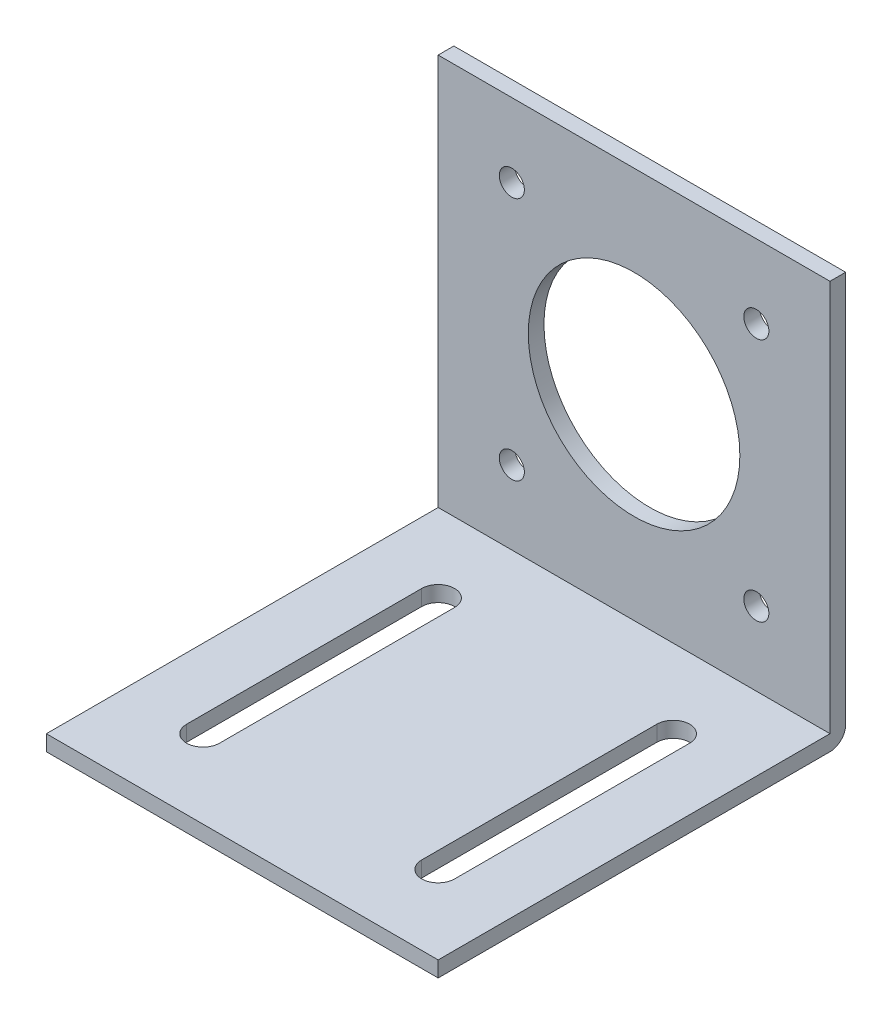
ISO-10303-21;
HEADER;
FILE_DESCRIPTION(('STEP AP214'),'2;1');
FILE_NAME('part.step','',(''),(''),'','','');
FILE_SCHEMA(('AUTOMOTIVE_DESIGN { 1 0 10303 214 1 1 1 1 }'));
ENDSEC;
DATA;
#1=APPLICATION_CONTEXT('core data for automotive mechanical design processes');
#2=APPLICATION_PROTOCOL_DEFINITION('international standard','automotive_design',2000,#1);
#3=PRODUCT_CONTEXT('',#1,'mechanical');
#4=PRODUCT('Part','Part','',(#3));
#5=PRODUCT_RELATED_PRODUCT_CATEGORY('part','',(#4));
#6=PRODUCT_DEFINITION_FORMATION('','',#4);
#7=PRODUCT_DEFINITION_CONTEXT('part definition',#1,'design');
#8=PRODUCT_DEFINITION('design','',#6,#7);
#9=PRODUCT_DEFINITION_SHAPE('','',#8);
#10=(LENGTH_UNIT() NAMED_UNIT(*) SI_UNIT(.MILLI.,.METRE.));
#11=(NAMED_UNIT(*) PLANE_ANGLE_UNIT() SI_UNIT($,.RADIAN.));
#12=(NAMED_UNIT(*) SI_UNIT($,.STERADIAN.) SOLID_ANGLE_UNIT());
#13=UNCERTAINTY_MEASURE_WITH_UNIT(LENGTH_MEASURE(1.E-05),#10,'distance_accuracy_value','');
#14=(GEOMETRIC_REPRESENTATION_CONTEXT(3) GLOBAL_UNCERTAINTY_ASSIGNED_CONTEXT((#13)) GLOBAL_UNIT_ASSIGNED_CONTEXT((#10,
#11,#12)) REPRESENTATION_CONTEXT('',''));
#15=CARTESIAN_POINT('',(0.,0.,0.));
#16=DIRECTION('',(0.,0.,1.));
#17=DIRECTION('',(1.,0.,0.));
#18=AXIS2_PLACEMENT_3D('',#15,#16,#17);
#19=CARTESIAN_POINT('',(0.,2.,0.));
#20=DIRECTION('',(0.,-1.,0.));
#21=DIRECTION('',(0.,0.,-1.));
#22=AXIS2_PLACEMENT_3D('',#19,#20,#21);
#23=PLANE('',#22);
#24=CARTESIAN_POINT('',(-15.,2.,-15.));
#25=DIRECTION('',(0.,1.,0.));
#26=DIRECTION('',(0.,0.,1.));
#27=AXIS2_PLACEMENT_3D('',#24,#25,#26);
#28=CIRCLE('',#27,2.1);
#29=CARTESIAN_POINT('',(-12.9,2.,-15.));
#30=VERTEX_POINT('',#29);
#31=CARTESIAN_POINT('',(-17.1,2.,-15.));
#32=VERTEX_POINT('',#31);
#33=EDGE_CURVE('E207',#30,#32,#28,.T.);
#34=ORIENTED_EDGE('',*,*,#33,.F.);
#35=DIRECTION('',(0.,0.,-1.));
#36=VECTOR('',#35,1.);
#37=CARTESIAN_POINT('',(-12.9,2.,-15.));
#38=LINE('',#37,#36);
#39=CARTESIAN_POINT('',(-12.9,2.,15.));
#40=VERTEX_POINT('',#39);
#41=EDGE_CURVE('E215',#40,#30,#38,.T.);
#42=ORIENTED_EDGE('',*,*,#41,.F.);
#43=CARTESIAN_POINT('',(-15.,2.,15.));
#44=DIRECTION('',(0.,1.,0.));
#45=DIRECTION('',(0.,0.,1.));
#46=AXIS2_PLACEMENT_3D('',#43,#44,#45);
#47=CIRCLE('',#46,2.1);
#48=CARTESIAN_POINT('',(-17.1,2.,15.));
#49=VERTEX_POINT('',#48);
#50=EDGE_CURVE('E212',#49,#40,#47,.T.);
#51=ORIENTED_EDGE('',*,*,#50,.F.);
#52=DIRECTION('',(0.,0.,1.));
#53=VECTOR('',#52,1.);
#54=CARTESIAN_POINT('',(-17.1,2.,-15.));
#55=LINE('',#54,#53);
#56=EDGE_CURVE('E209',#32,#49,#55,.T.);
#57=ORIENTED_EDGE('',*,*,#56,.F.);
#58=EDGE_LOOP('',(#34,#42,#51,#57));
#59=FACE_BOUND('',#58,.T.);
#60=DIRECTION('',(0.,0.,-1.));
#61=VECTOR('',#60,1.);
#62=CARTESIAN_POINT('',(25.,2.,25.));
#63=LINE('',#62,#61);
#64=CARTESIAN_POINT('',(25.,2.,25.));
#65=VERTEX_POINT('',#64);
#66=CARTESIAN_POINT('',(25.,2.00000000000002,-25.));
#67=VERTEX_POINT('',#66);
#68=EDGE_CURVE('E238',#65,#67,#63,.T.);
#69=ORIENTED_EDGE('',*,*,#68,.T.);
#70=DIRECTION('',(-1.,0.,0.));
#71=VECTOR('',#70,1.);
#72=CARTESIAN_POINT('',(-25.,2.,-25.));
#73=LINE('',#72,#71);
#74=CARTESIAN_POINT('',(-25.,2.,-25.));
#75=VERTEX_POINT('',#74);
#76=EDGE_CURVE('E143',#67,#75,#73,.T.);
#77=ORIENTED_EDGE('',*,*,#76,.T.);
#78=DIRECTION('',(0.,0.,1.));
#79=VECTOR('',#78,1.);
#80=CARTESIAN_POINT('',(-25.,2.,25.));
#81=LINE('',#80,#79);
#82=CARTESIAN_POINT('',(-25.,2.,25.));
#83=VERTEX_POINT('',#82);
#84=EDGE_CURVE('E242',#75,#83,#81,.T.);
#85=ORIENTED_EDGE('',*,*,#84,.T.);
#86=DIRECTION('',(1.,0.,0.));
#87=VECTOR('',#86,1.);
#88=CARTESIAN_POINT('',(-25.,2.,25.));
#89=LINE('',#88,#87);
#90=EDGE_CURVE('E244',#83,#65,#89,.T.);
#91=ORIENTED_EDGE('',*,*,#90,.T.);
#92=EDGE_LOOP('',(#69,#77,#85,#91));
#93=FACE_BOUND('',#92,.T.);
#94=CARTESIAN_POINT('',(15.,2.,-15.));
#95=DIRECTION('',(0.,1.,0.));
#96=DIRECTION('',(0.,0.,-1.));
#97=AXIS2_PLACEMENT_3D('',#94,#95,#96);
#98=CIRCLE('',#97,2.1);
#99=CARTESIAN_POINT('',(17.1,2.,-15.));
#100=VERTEX_POINT('',#99);
#101=CARTESIAN_POINT('',(12.9,2.,-15.));
#102=VERTEX_POINT('',#101);
#103=EDGE_CURVE('E176',#100,#102,#98,.T.);
#104=ORIENTED_EDGE('',*,*,#103,.F.);
#105=DIRECTION('',(0.,0.,-1.));
#106=VECTOR('',#105,1.);
#107=CARTESIAN_POINT('',(17.1,2.,-15.));
#108=LINE('',#107,#106);
#109=CARTESIAN_POINT('',(17.1,2.,15.));
#110=VERTEX_POINT('',#109);
#111=EDGE_CURVE('E184',#110,#100,#108,.T.);
#112=ORIENTED_EDGE('',*,*,#111,.F.);
#113=CARTESIAN_POINT('',(15.,2.,15.));
#114=DIRECTION('',(0.,1.,0.));
#115=DIRECTION('',(0.,0.,-1.));
#116=AXIS2_PLACEMENT_3D('',#113,#114,#115);
#117=CIRCLE('',#116,2.1);
#118=CARTESIAN_POINT('',(12.9,2.,15.));
#119=VERTEX_POINT('',#118);
#120=EDGE_CURVE('E181',#119,#110,#117,.T.);
#121=ORIENTED_EDGE('',*,*,#120,.F.);
#122=DIRECTION('',(0.,0.,1.));
#123=VECTOR('',#122,1.);
#124=CARTESIAN_POINT('',(12.9,2.,-15.));
#125=LINE('',#124,#123);
#126=EDGE_CURVE('E178',#102,#119,#125,.T.);
#127=ORIENTED_EDGE('',*,*,#126,.F.);
#128=EDGE_LOOP('',(#104,#112,#121,#127));
#129=FACE_BOUND('',#128,.T.);
#130=ADVANCED_FACE('F33',(#59,#93,#129),#23,.F.);
#131=CARTESIAN_POINT('',(0.,0.,0.));
#132=DIRECTION('',(0.,-1.,0.));
#133=DIRECTION('',(0.,0.,-1.));
#134=AXIS2_PLACEMENT_3D('',#131,#132,#133);
#135=PLANE('',#134);
#136=DIRECTION('',(0.,0.,1.));
#137=VECTOR('',#136,1.);
#138=CARTESIAN_POINT('',(-25.,0.,25.));
#139=LINE('',#138,#137);
#140=CARTESIAN_POINT('',(-25.,0.,-25.));
#141=VERTEX_POINT('',#140);
#142=CARTESIAN_POINT('',(-25.,0.,25.));
#143=VERTEX_POINT('',#142);
#144=EDGE_CURVE('E248',#141,#143,#139,.T.);
#145=ORIENTED_EDGE('',*,*,#144,.F.);
#146=DIRECTION('',(1.,0.,0.));
#147=VECTOR('',#146,1.);
#148=CARTESIAN_POINT('',(0.,0.,-25.));
#149=LINE('',#148,#147);
#150=CARTESIAN_POINT('',(25.,0.,-25.));
#151=VERTEX_POINT('',#150);
#152=EDGE_CURVE('E256',#141,#151,#149,.T.);
#153=ORIENTED_EDGE('',*,*,#152,.T.);
#154=DIRECTION('',(0.,0.,-1.));
#155=VECTOR('',#154,1.);
#156=CARTESIAN_POINT('',(25.,0.,25.));
#157=LINE('',#156,#155);
#158=CARTESIAN_POINT('',(25.,0.,25.));
#159=VERTEX_POINT('',#158);
#160=EDGE_CURVE('E237',#159,#151,#157,.T.);
#161=ORIENTED_EDGE('',*,*,#160,.F.);
#162=DIRECTION('',(1.,0.,0.));
#163=VECTOR('',#162,1.);
#164=CARTESIAN_POINT('',(-25.,0.,25.));
#165=LINE('',#164,#163);
#166=EDGE_CURVE('E240',#143,#159,#165,.T.);
#167=ORIENTED_EDGE('',*,*,#166,.F.);
#168=EDGE_LOOP('',(#145,#153,#161,#167));
#169=FACE_BOUND('',#168,.T.);
#170=DIRECTION('',(0.,0.,-1.));
#171=VECTOR('',#170,1.);
#172=CARTESIAN_POINT('',(-12.9,0.,-15.));
#173=LINE('',#172,#171);
#174=CARTESIAN_POINT('',(-12.9,0.,15.));
#175=VERTEX_POINT('',#174);
#176=CARTESIAN_POINT('',(-12.9,0.,-15.));
#177=VERTEX_POINT('',#176);
#178=EDGE_CURVE('E210',#175,#177,#173,.T.);
#179=ORIENTED_EDGE('',*,*,#178,.T.);
#180=CARTESIAN_POINT('',(-15.,0.,-15.));
#181=DIRECTION('',(0.,1.,0.));
#182=DIRECTION('',(0.,0.,1.));
#183=AXIS2_PLACEMENT_3D('',#180,#181,#182);
#184=CIRCLE('',#183,2.1);
#185=CARTESIAN_POINT('',(-17.1,0.,-15.));
#186=VERTEX_POINT('',#185);
#187=EDGE_CURVE('E206',#177,#186,#184,.T.);
#188=ORIENTED_EDGE('',*,*,#187,.T.);
#189=DIRECTION('',(0.,0.,1.));
#190=VECTOR('',#189,1.);
#191=CARTESIAN_POINT('',(-17.1,0.,-15.));
#192=LINE('',#191,#190);
#193=CARTESIAN_POINT('',(-17.1,0.,15.));
#194=VERTEX_POINT('',#193);
#195=EDGE_CURVE('E220',#186,#194,#192,.T.);
#196=ORIENTED_EDGE('',*,*,#195,.T.);
#197=CARTESIAN_POINT('',(-15.,0.,15.));
#198=DIRECTION('',(0.,1.,0.));
#199=DIRECTION('',(0.,0.,1.));
#200=AXIS2_PLACEMENT_3D('',#197,#198,#199);
#201=CIRCLE('',#200,2.1);
#202=EDGE_CURVE('E223',#194,#175,#201,.T.);
#203=ORIENTED_EDGE('',*,*,#202,.T.);
#204=EDGE_LOOP('',(#179,#188,#196,#203));
#205=FACE_BOUND('',#204,.T.);
#206=DIRECTION('',(0.,0.,-1.));
#207=VECTOR('',#206,1.);
#208=CARTESIAN_POINT('',(17.1,0.,-15.));
#209=LINE('',#208,#207);
#210=CARTESIAN_POINT('',(17.1,0.,15.));
#211=VERTEX_POINT('',#210);
#212=CARTESIAN_POINT('',(17.1,0.,-15.));
#213=VERTEX_POINT('',#212);
#214=EDGE_CURVE('E179',#211,#213,#209,.T.);
#215=ORIENTED_EDGE('',*,*,#214,.T.);
#216=CARTESIAN_POINT('',(15.,0.,-15.));
#217=DIRECTION('',(0.,1.,0.));
#218=DIRECTION('',(0.,0.,-1.));
#219=AXIS2_PLACEMENT_3D('',#216,#217,#218);
#220=CIRCLE('',#219,2.1);
#221=CARTESIAN_POINT('',(12.9,0.,-15.));
#222=VERTEX_POINT('',#221);
#223=EDGE_CURVE('E172',#213,#222,#220,.T.);
#224=ORIENTED_EDGE('',*,*,#223,.T.);
#225=DIRECTION('',(0.,0.,1.));
#226=VECTOR('',#225,1.);
#227=CARTESIAN_POINT('',(12.9,0.,-15.));
#228=LINE('',#227,#226);
#229=CARTESIAN_POINT('',(12.9,0.,15.));
#230=VERTEX_POINT('',#229);
#231=EDGE_CURVE('E189',#222,#230,#228,.T.);
#232=ORIENTED_EDGE('',*,*,#231,.T.);
#233=CARTESIAN_POINT('',(15.,0.,15.));
#234=DIRECTION('',(0.,1.,0.));
#235=DIRECTION('',(0.,0.,-1.));
#236=AXIS2_PLACEMENT_3D('',#233,#234,#235);
#237=CIRCLE('',#236,2.1);
#238=EDGE_CURVE('E192',#230,#211,#237,.T.);
#239=ORIENTED_EDGE('',*,*,#238,.T.);
#240=EDGE_LOOP('',(#215,#224,#232,#239));
#241=FACE_BOUND('',#240,.T.);
#242=ADVANCED_FACE('F263',(#169,#205,#241),#135,.T.);
#243=CARTESIAN_POINT('',(25.,2.,25.));
#244=DIRECTION('',(-1.,0.,0.));
#245=DIRECTION('',(0.,0.,1.));
#246=AXIS2_PLACEMENT_3D('',#243,#244,#245);
#247=PLANE('',#246);
#248=ORIENTED_EDGE('',*,*,#160,.T.);
#249=CARTESIAN_POINT('',(25.,2.,-25.));
#250=DIRECTION('',(-1.,0.,0.));
#251=DIRECTION('',(0.,0.,1.));
#252=AXIS2_PLACEMENT_3D('',#249,#250,#251);
#253=CIRCLE('',#252,2.);
#254=CARTESIAN_POINT('',(25.,2.00000000000002,-27.));
#255=VERTEX_POINT('',#254);
#256=EDGE_CURVE('E55',#151,#255,#253,.F.);
#257=ORIENTED_EDGE('',*,*,#256,.T.);
#258=DIRECTION('',(0.,-1.,0.));
#259=VECTOR('',#258,1.);
#260=CARTESIAN_POINT('',(25.,52.,-27.));
#261=LINE('',#260,#259);
#262=CARTESIAN_POINT('',(25.,52.,-27.));
#263=VERTEX_POINT('',#262);
#264=EDGE_CURVE('E161',#263,#255,#261,.T.);
#265=ORIENTED_EDGE('',*,*,#264,.F.);
#266=DIRECTION('',(0.,0.,1.));
#267=VECTOR('',#266,1.);
#268=CARTESIAN_POINT('',(25.,52.,-25.));
#269=LINE('',#268,#267);
#270=CARTESIAN_POINT('',(25.,52.,-25.));
#271=VERTEX_POINT('',#270);
#272=EDGE_CURVE('E155',#263,#271,#269,.T.);
#273=ORIENTED_EDGE('',*,*,#272,.T.);
#274=DIRECTION('',(0.,-1.,0.));
#275=VECTOR('',#274,1.);
#276=CARTESIAN_POINT('',(25.,52.,-25.));
#277=LINE('',#276,#275);
#278=EDGE_CURVE('E138',#271,#67,#277,.T.);
#279=ORIENTED_EDGE('',*,*,#278,.T.);
#280=ORIENTED_EDGE('',*,*,#68,.F.);
#281=DIRECTION('',(0.,-1.,0.));
#282=VECTOR('',#281,1.);
#283=CARTESIAN_POINT('',(25.,2.,25.));
#284=LINE('',#283,#282);
#285=EDGE_CURVE('E246',#65,#159,#284,.T.);
#286=ORIENTED_EDGE('',*,*,#285,.T.);
#287=EDGE_LOOP('',(#248,#257,#265,#273,#279,#280,#286));
#288=FACE_BOUND('',#287,.T.);
#289=ADVANCED_FACE('F160',(#288),#247,.F.);
#290=CARTESIAN_POINT('',(-25.,2.,25.));
#291=DIRECTION('',(1.,0.,0.));
#292=DIRECTION('',(0.,0.,-1.));
#293=AXIS2_PLACEMENT_3D('',#290,#291,#292);
#294=PLANE('',#293);
#295=DIRECTION('',(0.,-1.,0.));
#296=VECTOR('',#295,1.);
#297=CARTESIAN_POINT('',(-25.,52.,-27.));
#298=LINE('',#297,#296);
#299=CARTESIAN_POINT('',(-25.,52.,-27.));
#300=VERTEX_POINT('',#299);
#301=CARTESIAN_POINT('',(-25.,2.00000000000002,-27.));
#302=VERTEX_POINT('',#301);
#303=EDGE_CURVE('E173',#300,#302,#298,.T.);
#304=ORIENTED_EDGE('',*,*,#303,.T.);
#305=CARTESIAN_POINT('',(-25.,2.,-25.));
#306=DIRECTION('',(1.,0.,0.));
#307=DIRECTION('',(0.,0.,-1.));
#308=AXIS2_PLACEMENT_3D('',#305,#306,#307);
#309=CIRCLE('',#308,2.);
#310=EDGE_CURVE('E11',#302,#141,#309,.F.);
#311=ORIENTED_EDGE('',*,*,#310,.T.);
#312=ORIENTED_EDGE('',*,*,#144,.T.);
#313=DIRECTION('',(0.,-1.,0.));
#314=VECTOR('',#313,1.);
#315=CARTESIAN_POINT('',(-25.,2.,25.));
#316=LINE('',#315,#314);
#317=EDGE_CURVE('E253',#83,#143,#316,.T.);
#318=ORIENTED_EDGE('',*,*,#317,.F.);
#319=ORIENTED_EDGE('',*,*,#84,.F.);
#320=DIRECTION('',(0.,-1.,0.));
#321=VECTOR('',#320,1.);
#322=CARTESIAN_POINT('',(-25.,52.,-25.));
#323=LINE('',#322,#321);
#324=CARTESIAN_POINT('',(-25.,52.,-25.));
#325=VERTEX_POINT('',#324);
#326=EDGE_CURVE('E147',#325,#75,#323,.T.);
#327=ORIENTED_EDGE('',*,*,#326,.F.);
#328=DIRECTION('',(0.,0.,-1.));
#329=VECTOR('',#328,1.);
#330=CARTESIAN_POINT('',(-25.,52.,-25.));
#331=LINE('',#330,#329);
#332=EDGE_CURVE('E158',#325,#300,#331,.T.);
#333=ORIENTED_EDGE('',*,*,#332,.T.);
#334=EDGE_LOOP('',(#304,#311,#312,#318,#319,#327,#333));
#335=FACE_BOUND('',#334,.T.);
#336=ADVANCED_FACE('F275',(#335),#294,.F.);
#337=CARTESIAN_POINT('',(-25.,2.,25.));
#338=DIRECTION('',(0.,0.,-1.));
#339=DIRECTION('',(-1.,0.,0.));
#340=AXIS2_PLACEMENT_3D('',#337,#338,#339);
#341=PLANE('',#340);
#342=ORIENTED_EDGE('',*,*,#166,.T.);
#343=ORIENTED_EDGE('',*,*,#285,.F.);
#344=ORIENTED_EDGE('',*,*,#90,.F.);
#345=ORIENTED_EDGE('',*,*,#317,.T.);
#346=EDGE_LOOP('',(#342,#343,#344,#345));
#347=FACE_BOUND('',#346,.T.);
#348=ADVANCED_FACE('F271',(#347),#341,.F.);
#349=CARTESIAN_POINT('',(-15.,2.,-15.));
#350=DIRECTION('',(0.,-1.,0.));
#351=DIRECTION('',(0.,0.,-1.));
#352=AXIS2_PLACEMENT_3D('',#349,#350,#351);
#353=CYLINDRICAL_SURFACE('',#352,2.1);
#354=ORIENTED_EDGE('',*,*,#187,.F.);
#355=DIRECTION('',(0.,-1.,0.));
#356=VECTOR('',#355,1.);
#357=CARTESIAN_POINT('',(-12.9,2.,-15.));
#358=LINE('',#357,#356);
#359=EDGE_CURVE('E217',#30,#177,#358,.T.);
#360=ORIENTED_EDGE('',*,*,#359,.F.);
#361=ORIENTED_EDGE('',*,*,#33,.T.);
#362=DIRECTION('',(0.,-1.,0.));
#363=VECTOR('',#362,1.);
#364=CARTESIAN_POINT('',(-17.1,2.,-15.));
#365=LINE('',#364,#363);
#366=EDGE_CURVE('E234',#32,#186,#365,.T.);
#367=ORIENTED_EDGE('',*,*,#366,.T.);
#368=EDGE_LOOP('',(#354,#360,#361,#367));
#369=FACE_BOUND('',#368,.T.);
#370=ADVANCED_FACE('F296',(#369),#353,.F.);
#371=CARTESIAN_POINT('',(-17.1,2.,-15.));
#372=DIRECTION('',(1.,0.,0.));
#373=DIRECTION('',(0.,0.,-1.));
#374=AXIS2_PLACEMENT_3D('',#371,#372,#373);
#375=PLANE('',#374);
#376=ORIENTED_EDGE('',*,*,#195,.F.);
#377=ORIENTED_EDGE('',*,*,#366,.F.);
#378=ORIENTED_EDGE('',*,*,#56,.T.);
#379=DIRECTION('',(0.,-1.,0.));
#380=VECTOR('',#379,1.);
#381=CARTESIAN_POINT('',(-17.1,2.,15.));
#382=LINE('',#381,#380);
#383=EDGE_CURVE('E232',#49,#194,#382,.T.);
#384=ORIENTED_EDGE('',*,*,#383,.T.);
#385=EDGE_LOOP('',(#376,#377,#378,#384));
#386=FACE_BOUND('',#385,.T.);
#387=ADVANCED_FACE('F451',(#386),#375,.T.);
#388=CARTESIAN_POINT('',(-15.,2.,15.));
#389=DIRECTION('',(0.,-1.,0.));
#390=DIRECTION('',(0.,0.,-1.));
#391=AXIS2_PLACEMENT_3D('',#388,#389,#390);
#392=CYLINDRICAL_SURFACE('',#391,2.1);
#393=ORIENTED_EDGE('',*,*,#202,.F.);
#394=ORIENTED_EDGE('',*,*,#383,.F.);
#395=ORIENTED_EDGE('',*,*,#50,.T.);
#396=DIRECTION('',(0.,-1.,0.));
#397=VECTOR('',#396,1.);
#398=CARTESIAN_POINT('',(-12.9,2.,15.));
#399=LINE('',#398,#397);
#400=EDGE_CURVE('E230',#40,#175,#399,.T.);
#401=ORIENTED_EDGE('',*,*,#400,.T.);
#402=EDGE_LOOP('',(#393,#394,#395,#401));
#403=FACE_BOUND('',#402,.T.);
#404=ADVANCED_FACE('F442',(#403),#392,.F.);
#405=CARTESIAN_POINT('',(-12.9,2.,-15.));
#406=DIRECTION('',(-1.,0.,0.));
#407=DIRECTION('',(0.,0.,1.));
#408=AXIS2_PLACEMENT_3D('',#405,#406,#407);
#409=PLANE('',#408);
#410=ORIENTED_EDGE('',*,*,#178,.F.);
#411=ORIENTED_EDGE('',*,*,#400,.F.);
#412=ORIENTED_EDGE('',*,*,#41,.T.);
#413=ORIENTED_EDGE('',*,*,#359,.T.);
#414=EDGE_LOOP('',(#410,#411,#412,#413));
#415=FACE_BOUND('',#414,.T.);
#416=ADVANCED_FACE('F433',(#415),#409,.T.);
#417=CARTESIAN_POINT('',(15.,2.,-15.));
#418=DIRECTION('',(0.,-1.,0.));
#419=DIRECTION('',(0.,0.,-1.));
#420=AXIS2_PLACEMENT_3D('',#417,#418,#419);
#421=CYLINDRICAL_SURFACE('',#420,2.1);
#422=ORIENTED_EDGE('',*,*,#223,.F.);
#423=DIRECTION('',(0.,-1.,0.));
#424=VECTOR('',#423,1.);
#425=CARTESIAN_POINT('',(17.1,2.,-15.));
#426=LINE('',#425,#424);
#427=EDGE_CURVE('E186',#100,#213,#426,.T.);
#428=ORIENTED_EDGE('',*,*,#427,.F.);
#429=ORIENTED_EDGE('',*,*,#103,.T.);
#430=DIRECTION('',(0.,-1.,0.));
#431=VECTOR('',#430,1.);
#432=CARTESIAN_POINT('',(12.9,2.,-15.));
#433=LINE('',#432,#431);
#434=EDGE_CURVE('E203',#102,#222,#433,.T.);
#435=ORIENTED_EDGE('',*,*,#434,.T.);
#436=EDGE_LOOP('',(#422,#428,#429,#435));
#437=FACE_BOUND('',#436,.T.);
#438=ADVANCED_FACE('F424',(#437),#421,.F.);
#439=CARTESIAN_POINT('',(12.9,2.,-15.));
#440=DIRECTION('',(1.,0.,0.));
#441=DIRECTION('',(0.,0.,-1.));
#442=AXIS2_PLACEMENT_3D('',#439,#440,#441);
#443=PLANE('',#442);
#444=ORIENTED_EDGE('',*,*,#231,.F.);
#445=ORIENTED_EDGE('',*,*,#434,.F.);
#446=ORIENTED_EDGE('',*,*,#126,.T.);
#447=DIRECTION('',(0.,-1.,0.));
#448=VECTOR('',#447,1.);
#449=CARTESIAN_POINT('',(12.9,2.,15.));
#450=LINE('',#449,#448);
#451=EDGE_CURVE('E201',#119,#230,#450,.T.);
#452=ORIENTED_EDGE('',*,*,#451,.T.);
#453=EDGE_LOOP('',(#444,#445,#446,#452));
#454=FACE_BOUND('',#453,.T.);
#455=ADVANCED_FACE('F415',(#454),#443,.T.);
#456=CARTESIAN_POINT('',(15.,2.,15.));
#457=DIRECTION('',(0.,-1.,0.));
#458=DIRECTION('',(0.,0.,-1.));
#459=AXIS2_PLACEMENT_3D('',#456,#457,#458);
#460=CYLINDRICAL_SURFACE('',#459,2.1);
#461=ORIENTED_EDGE('',*,*,#238,.F.);
#462=ORIENTED_EDGE('',*,*,#451,.F.);
#463=ORIENTED_EDGE('',*,*,#120,.T.);
#464=DIRECTION('',(0.,-1.,0.));
#465=VECTOR('',#464,1.);
#466=CARTESIAN_POINT('',(17.1,2.,15.));
#467=LINE('',#466,#465);
#468=EDGE_CURVE('E199',#110,#211,#467,.T.);
#469=ORIENTED_EDGE('',*,*,#468,.T.);
#470=EDGE_LOOP('',(#461,#462,#463,#469));
#471=FACE_BOUND('',#470,.T.);
#472=ADVANCED_FACE('F406',(#471),#460,.F.);
#473=CARTESIAN_POINT('',(17.1,2.,-15.));
#474=DIRECTION('',(-1.,0.,0.));
#475=DIRECTION('',(0.,0.,1.));
#476=AXIS2_PLACEMENT_3D('',#473,#474,#475);
#477=PLANE('',#476);
#478=ORIENTED_EDGE('',*,*,#214,.F.);
#479=ORIENTED_EDGE('',*,*,#468,.F.);
#480=ORIENTED_EDGE('',*,*,#111,.T.);
#481=ORIENTED_EDGE('',*,*,#427,.T.);
#482=EDGE_LOOP('',(#478,#479,#480,#481));
#483=FACE_BOUND('',#482,.T.);
#484=ADVANCED_FACE('F378',(#483),#477,.T.);
#485=CARTESIAN_POINT('',(25.,52.,-25.));
#486=DIRECTION('',(0.,0.,1.));
#487=DIRECTION('',(1.,0.,0.));
#488=AXIS2_PLACEMENT_3D('',#485,#486,#487);
#489=PLANE('',#488);
#490=CARTESIAN_POINT('',(-15.5999999999997,11.4,-25.));
#491=DIRECTION('',(0.,0.,1.));
#492=DIRECTION('',(1.,0.,0.));
#493=AXIS2_PLACEMENT_3D('',#490,#491,#492);
#494=CIRCLE('',#493,1.6);
#495=CARTESIAN_POINT('',(-13.9999999999997,11.4,-25.));
#496=VERTEX_POINT('',#495);
#497=EDGE_CURVE('E507',#496,#496,#494,.T.);
#498=ORIENTED_EDGE('',*,*,#497,.F.);
#499=EDGE_LOOP('',(#498));
#500=FACE_BOUND('',#499,.T.);
#501=CARTESIAN_POINT('',(15.6000000000003,11.4,-25.));
#502=DIRECTION('',(0.,0.,1.));
#503=DIRECTION('',(1.,0.,0.));
#504=AXIS2_PLACEMENT_3D('',#501,#502,#503);
#505=CIRCLE('',#504,1.6);
#506=CARTESIAN_POINT('',(17.2000000000003,11.4,-25.));
#507=VERTEX_POINT('',#506);
#508=EDGE_CURVE('E511',#507,#507,#505,.T.);
#509=ORIENTED_EDGE('',*,*,#508,.F.);
#510=EDGE_LOOP('',(#509));
#511=FACE_BOUND('',#510,.T.);
#512=CARTESIAN_POINT('',(15.6,42.6,-25.));
#513=DIRECTION('',(0.,0.,1.));
#514=DIRECTION('',(1.,0.,0.));
#515=AXIS2_PLACEMENT_3D('',#512,#513,#514);
#516=CIRCLE('',#515,1.6);
#517=CARTESIAN_POINT('',(17.2,42.6,-25.));
#518=VERTEX_POINT('',#517);
#519=EDGE_CURVE('E515',#518,#518,#516,.T.);
#520=ORIENTED_EDGE('',*,*,#519,.F.);
#521=EDGE_LOOP('',(#520));
#522=FACE_BOUND('',#521,.T.);
#523=CARTESIAN_POINT('',(0.,27.,-25.));
#524=DIRECTION('',(0.,0.,1.));
#525=DIRECTION('',(1.,0.,0.));
#526=AXIS2_PLACEMENT_3D('',#523,#524,#525);
#527=CIRCLE('',#526,13.5);
#528=CARTESIAN_POINT('',(13.5,27.,-25.));
#529=VERTEX_POINT('',#528);
#530=EDGE_CURVE('E519',#529,#529,#527,.T.);
#531=ORIENTED_EDGE('',*,*,#530,.F.);
#532=EDGE_LOOP('',(#531));
#533=FACE_BOUND('',#532,.T.);
#534=CARTESIAN_POINT('',(-15.6,42.6,-25.));
#535=DIRECTION('',(0.,0.,1.));
#536=DIRECTION('',(1.,0.,0.));
#537=AXIS2_PLACEMENT_3D('',#534,#535,#536);
#538=CIRCLE('',#537,1.6);
#539=CARTESIAN_POINT('',(-14.,42.6,-25.));
#540=VERTEX_POINT('',#539);
#541=EDGE_CURVE('E162',#540,#540,#538,.T.);
#542=ORIENTED_EDGE('',*,*,#541,.F.);
#543=EDGE_LOOP('',(#542));
#544=FACE_BOUND('',#543,.T.);
#545=ORIENTED_EDGE('',*,*,#76,.F.);
#546=ORIENTED_EDGE('',*,*,#278,.F.);
#547=DIRECTION('',(-1.,0.,0.));
#548=VECTOR('',#547,1.);
#549=CARTESIAN_POINT('',(25.,52.,-25.));
#550=LINE('',#549,#548);
#551=EDGE_CURVE('E141',#271,#325,#550,.T.);
#552=ORIENTED_EDGE('',*,*,#551,.T.);
#553=ORIENTED_EDGE('',*,*,#326,.T.);
#554=EDGE_LOOP('',(#545,#546,#552,#553));
#555=FACE_BOUND('',#554,.T.);
#556=ADVANCED_FACE('F140',(#500,#511,#522,#533,#544,#555),#489,.T.);
#557=CARTESIAN_POINT('',(25.,52.,-27.));
#558=DIRECTION('',(0.,0.,-1.));
#559=DIRECTION('',(-1.,0.,0.));
#560=AXIS2_PLACEMENT_3D('',#557,#558,#559);
#561=PLANE('',#560);
#562=CARTESIAN_POINT('',(-15.5999999999997,11.4,-27.));
#563=DIRECTION('',(0.,0.,-1.));
#564=DIRECTION('',(-1.,0.,0.));
#565=AXIS2_PLACEMENT_3D('',#562,#563,#564);
#566=CIRCLE('',#565,1.6);
#567=CARTESIAN_POINT('',(-17.1999999999997,11.4,-27.));
#568=VERTEX_POINT('',#567);
#569=EDGE_CURVE('E538',#568,#568,#566,.F.);
#570=ORIENTED_EDGE('',*,*,#569,.T.);
#571=EDGE_LOOP('',(#570));
#572=FACE_BOUND('',#571,.T.);
#573=CARTESIAN_POINT('',(15.6000000000003,11.4,-27.));
#574=DIRECTION('',(0.,0.,-1.));
#575=DIRECTION('',(-1.,0.,0.));
#576=AXIS2_PLACEMENT_3D('',#573,#574,#575);
#577=CIRCLE('',#576,1.6);
#578=CARTESIAN_POINT('',(14.0000000000003,11.4,-27.));
#579=VERTEX_POINT('',#578);
#580=EDGE_CURVE('E534',#579,#579,#577,.F.);
#581=ORIENTED_EDGE('',*,*,#580,.T.);
#582=EDGE_LOOP('',(#581));
#583=FACE_BOUND('',#582,.T.);
#584=CARTESIAN_POINT('',(15.6,42.6,-27.));
#585=DIRECTION('',(0.,0.,-1.));
#586=DIRECTION('',(-1.,0.,0.));
#587=AXIS2_PLACEMENT_3D('',#584,#585,#586);
#588=CIRCLE('',#587,1.6);
#589=CARTESIAN_POINT('',(14.,42.6,-27.));
#590=VERTEX_POINT('',#589);
#591=EDGE_CURVE('E530',#590,#590,#588,.F.);
#592=ORIENTED_EDGE('',*,*,#591,.T.);
#593=EDGE_LOOP('',(#592));
#594=FACE_BOUND('',#593,.T.);
#595=CARTESIAN_POINT('',(0.,27.,-27.));
#596=DIRECTION('',(0.,0.,-1.));
#597=DIRECTION('',(-1.,0.,0.));
#598=AXIS2_PLACEMENT_3D('',#595,#596,#597);
#599=CIRCLE('',#598,13.5);
#600=CARTESIAN_POINT('',(-13.5,27.,-27.));
#601=VERTEX_POINT('',#600);
#602=EDGE_CURVE('E523',#601,#601,#599,.F.);
#603=ORIENTED_EDGE('',*,*,#602,.T.);
#604=EDGE_LOOP('',(#603));
#605=FACE_BOUND('',#604,.T.);
#606=CARTESIAN_POINT('',(-15.6,42.6,-27.));
#607=DIRECTION('',(0.,0.,-1.));
#608=DIRECTION('',(-1.,0.,0.));
#609=AXIS2_PLACEMENT_3D('',#606,#607,#608);
#610=CIRCLE('',#609,1.6);
#611=CARTESIAN_POINT('',(-17.2,42.6,-27.));
#612=VERTEX_POINT('',#611);
#613=EDGE_CURVE('E165',#612,#612,#610,.F.);
#614=ORIENTED_EDGE('',*,*,#613,.T.);
#615=EDGE_LOOP('',(#614));
#616=FACE_BOUND('',#615,.T.);
#617=ORIENTED_EDGE('',*,*,#264,.T.);
#618=DIRECTION('',(1.,0.,0.));
#619=VECTOR('',#618,1.);
#620=CARTESIAN_POINT('',(25.,2.,-27.));
#621=LINE('',#620,#619);
#622=EDGE_CURVE('E41',#255,#302,#621,.F.);
#623=ORIENTED_EDGE('',*,*,#622,.T.);
#624=ORIENTED_EDGE('',*,*,#303,.F.);
#625=DIRECTION('',(1.,0.,0.));
#626=VECTOR('',#625,1.);
#627=CARTESIAN_POINT('',(25.,52.,-27.));
#628=LINE('',#627,#626);
#629=EDGE_CURVE('E148',#300,#263,#628,.T.);
#630=ORIENTED_EDGE('',*,*,#629,.T.);
#631=EDGE_LOOP('',(#617,#623,#624,#630));
#632=FACE_BOUND('',#631,.T.);
#633=ADVANCED_FACE('F316',(#572,#583,#594,#605,#616,#632),#561,.T.);
#634=CARTESIAN_POINT('',(0.,52.,0.));
#635=DIRECTION('',(0.,1.,0.));
#636=DIRECTION('',(0.,0.,1.));
#637=AXIS2_PLACEMENT_3D('',#634,#635,#636);
#638=PLANE('',#637);
#639=ORIENTED_EDGE('',*,*,#272,.F.);
#640=ORIENTED_EDGE('',*,*,#629,.F.);
#641=ORIENTED_EDGE('',*,*,#332,.F.);
#642=ORIENTED_EDGE('',*,*,#551,.F.);
#643=EDGE_LOOP('',(#639,#640,#641,#642));
#644=FACE_BOUND('',#643,.T.);
#645=ADVANCED_FACE('F153',(#644),#638,.T.);
#646=CARTESIAN_POINT('',(-15.6,42.6,-27.001));
#647=DIRECTION('',(0.,0.,1.));
#648=DIRECTION('',(1.,0.,0.));
#649=AXIS2_PLACEMENT_3D('',#646,#647,#648);
#650=CYLINDRICAL_SURFACE('',#649,1.6);
#651=ORIENTED_EDGE('',*,*,#613,.F.);
#652=EDGE_LOOP('',(#651));
#653=FACE_BOUND('',#652,.T.);
#654=ORIENTED_EDGE('',*,*,#541,.T.);
#655=EDGE_LOOP('',(#654));
#656=FACE_BOUND('',#655,.T.);
#657=ADVANCED_FACE('F356',(#653,#656),#650,.F.);
#658=CARTESIAN_POINT('',(0.,27.,-27.001));
#659=DIRECTION('',(0.,0.,1.));
#660=DIRECTION('',(1.,0.,0.));
#661=AXIS2_PLACEMENT_3D('',#658,#659,#660);
#662=CYLINDRICAL_SURFACE('',#661,13.5);
#663=ORIENTED_EDGE('',*,*,#602,.F.);
#664=EDGE_LOOP('',(#663));
#665=FACE_BOUND('',#664,.T.);
#666=ORIENTED_EDGE('',*,*,#530,.T.);
#667=EDGE_LOOP('',(#666));
#668=FACE_BOUND('',#667,.T.);
#669=ADVANCED_FACE('F347',(#665,#668),#662,.F.);
#670=CARTESIAN_POINT('',(15.6,42.6,-27.001));
#671=DIRECTION('',(0.,0.,1.));
#672=DIRECTION('',(1.,0.,0.));
#673=AXIS2_PLACEMENT_3D('',#670,#671,#672);
#674=CYLINDRICAL_SURFACE('',#673,1.6);
#675=ORIENTED_EDGE('',*,*,#591,.F.);
#676=EDGE_LOOP('',(#675));
#677=FACE_BOUND('',#676,.T.);
#678=ORIENTED_EDGE('',*,*,#519,.T.);
#679=EDGE_LOOP('',(#678));
#680=FACE_BOUND('',#679,.T.);
#681=ADVANCED_FACE('F338',(#677,#680),#674,.F.);
#682=CARTESIAN_POINT('',(15.6000000000003,11.4,-27.001));
#683=DIRECTION('',(0.,0.,1.));
#684=DIRECTION('',(1.,0.,0.));
#685=AXIS2_PLACEMENT_3D('',#682,#683,#684);
#686=CYLINDRICAL_SURFACE('',#685,1.6);
#687=ORIENTED_EDGE('',*,*,#580,.F.);
#688=EDGE_LOOP('',(#687));
#689=FACE_BOUND('',#688,.T.);
#690=ORIENTED_EDGE('',*,*,#508,.T.);
#691=EDGE_LOOP('',(#690));
#692=FACE_BOUND('',#691,.T.);
#693=ADVANCED_FACE('F281',(#689,#692),#686,.F.);
#694=CARTESIAN_POINT('',(-15.5999999999997,11.4,-27.001));
#695=DIRECTION('',(0.,0.,1.));
#696=DIRECTION('',(1.,0.,0.));
#697=AXIS2_PLACEMENT_3D('',#694,#695,#696);
#698=CYLINDRICAL_SURFACE('',#697,1.6);
#699=ORIENTED_EDGE('',*,*,#569,.F.);
#700=EDGE_LOOP('',(#699));
#701=FACE_BOUND('',#700,.T.);
#702=ORIENTED_EDGE('',*,*,#497,.T.);
#703=EDGE_LOOP('',(#702));
#704=FACE_BOUND('',#703,.T.);
#705=ADVANCED_FACE('F277',(#701,#704),#698,.F.);
#706=CARTESIAN_POINT('',(0.,2.,-25.));
#707=DIRECTION('',(1.,0.,0.));
#708=DIRECTION('',(0.,0.,-1.));
#709=AXIS2_PLACEMENT_3D('',#706,#707,#708);
#710=CYLINDRICAL_SURFACE('',#709,2.);
#711=ORIENTED_EDGE('',*,*,#310,.F.);
#712=ORIENTED_EDGE('',*,*,#622,.F.);
#713=ORIENTED_EDGE('',*,*,#256,.F.);
#714=ORIENTED_EDGE('',*,*,#152,.F.);
#715=EDGE_LOOP('',(#711,#712,#713,#714));
#716=FACE_BOUND('',#715,.T.);
#717=ADVANCED_FACE('F35',(#716),#710,.T.);
#718=CLOSED_SHELL('',(#130,#242,#289,#336,#348,#370,#387,#404,#416,#438,#455,#472,#484,#556,
#633,#645,#657,#669,#681,#693,#705,#717));
#719=MANIFOLD_SOLID_BREP('B2',#718);
#720=ADVANCED_BREP_SHAPE_REPRESENTATION('',(#18,#719),#14);
#721=SHAPE_DEFINITION_REPRESENTATION(#9,#720);
ENDSEC;
END-ISO-10303-21;
